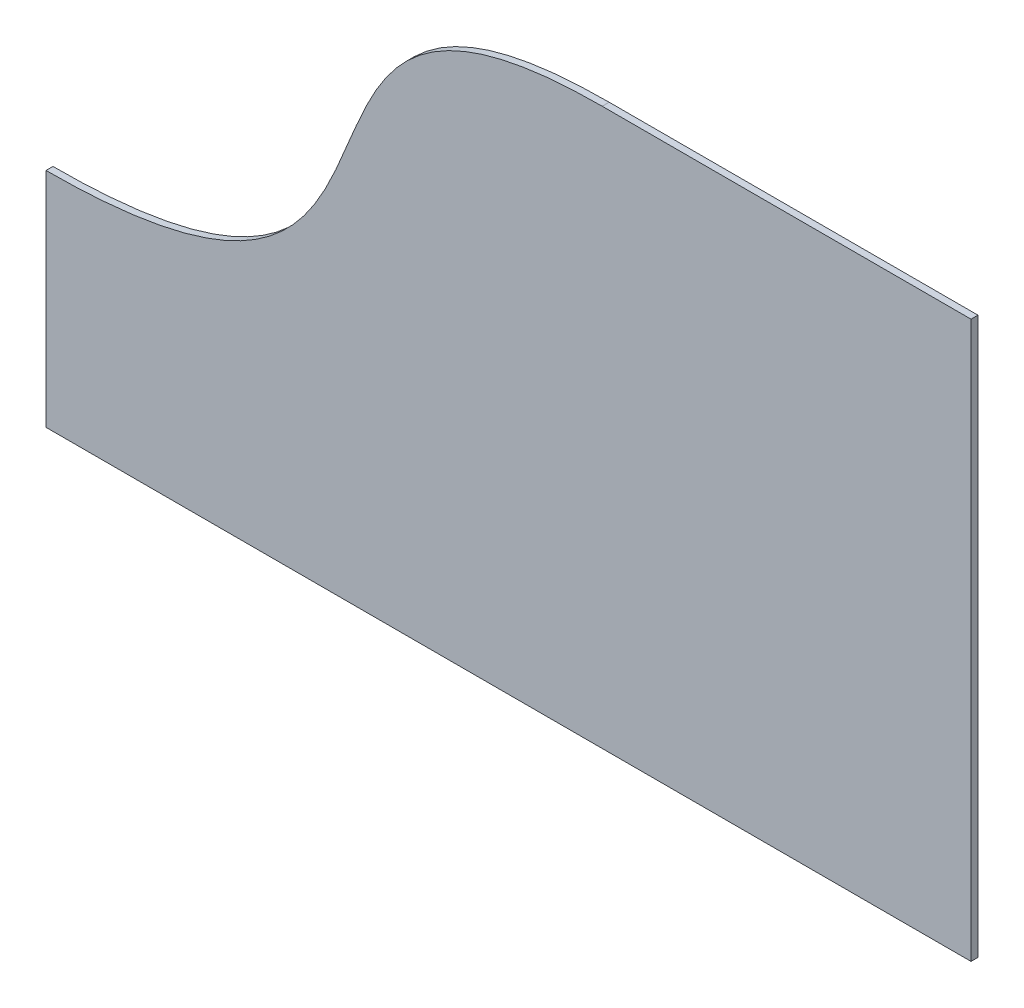
ISO-10303-21;
HEADER;
FILE_DESCRIPTION(('STEP AP214'),'2;1');
FILE_NAME('part.step','',(''),(''),'','','');
FILE_SCHEMA(('AUTOMOTIVE_DESIGN { 1 0 10303 214 1 1 1 1 }'));
ENDSEC;
DATA;
#1=APPLICATION_CONTEXT('core data for automotive mechanical design processes');
#2=APPLICATION_PROTOCOL_DEFINITION('international standard','automotive_design',2000,#1);
#3=PRODUCT_CONTEXT('',#1,'mechanical');
#4=PRODUCT('Part','Part','',(#3));
#5=PRODUCT_RELATED_PRODUCT_CATEGORY('part','',(#4));
#6=PRODUCT_DEFINITION_FORMATION('','',#4);
#7=PRODUCT_DEFINITION_CONTEXT('part definition',#1,'design');
#8=PRODUCT_DEFINITION('design','',#6,#7);
#9=PRODUCT_DEFINITION_SHAPE('','',#8);
#10=(LENGTH_UNIT() NAMED_UNIT(*) SI_UNIT(.MILLI.,.METRE.));
#11=(NAMED_UNIT(*) PLANE_ANGLE_UNIT() SI_UNIT($,.RADIAN.));
#12=(NAMED_UNIT(*) SI_UNIT($,.STERADIAN.) SOLID_ANGLE_UNIT());
#13=UNCERTAINTY_MEASURE_WITH_UNIT(LENGTH_MEASURE(1.E-05),#10,'distance_accuracy_value','');
#14=(GEOMETRIC_REPRESENTATION_CONTEXT(3) GLOBAL_UNCERTAINTY_ASSIGNED_CONTEXT((#13)) GLOBAL_UNIT_ASSIGNED_CONTEXT((#10,
#11,#12)) REPRESENTATION_CONTEXT('',''));
#15=CARTESIAN_POINT('',(0.,0.,0.));
#16=DIRECTION('',(0.,0.,1.));
#17=DIRECTION('',(1.,0.,0.));
#18=AXIS2_PLACEMENT_3D('',#15,#16,#17);
#19=CARTESIAN_POINT('',(-18.7822876391068,213.341972063542,3.175));
#20=CARTESIAN_POINT('',(-196.582287639107,213.341972063542,3.175));
#21=CARTESIAN_POINT('',(-69.5822876391068,60.9419720635418,3.175));
#22=CARTESIAN_POINT('',(-272.782287639107,60.9419720635417,3.175));
#23=B_SPLINE_CURVE_WITH_KNOTS('',3,(#19,#20,#21,#22),.UNSPECIFIED.,.F.,.F.,(4,4),(0.,1.),.UNSPECIFIED.);
#24=DIRECTION('',(0.,0.,-1.));
#25=VECTOR('',#24,1.);
#26=SURFACE_OF_LINEAR_EXTRUSION('',#23,#25);
#27=CARTESIAN_POINT('',(-18.7822876391068,213.341972063542,0.));
#28=CARTESIAN_POINT('',(-196.582287639107,213.341972063542,0.));
#29=CARTESIAN_POINT('',(-69.5822876391068,60.9419720635418,0.));
#30=CARTESIAN_POINT('',(-272.782287639107,60.9419720635417,0.));
#31=B_SPLINE_CURVE_WITH_KNOTS('',3,(#27,#28,#29,#30),.UNSPECIFIED.,.F.,.F.,(4,4),(0.,1.),.UNSPECIFIED.);
#32=CARTESIAN_POINT('',(-18.7822876391068,213.341972063542,0.));
#33=VERTEX_POINT('',#32);
#34=CARTESIAN_POINT('',(-272.782287639107,60.9419720635417,0.));
#35=VERTEX_POINT('',#34);
#36=EDGE_CURVE('E114',#33,#35,#31,.T.);
#37=ORIENTED_EDGE('',*,*,#36,.T.);
#38=DIRECTION('',(0.,0.,-1.));
#39=VECTOR('',#38,1.);
#40=CARTESIAN_POINT('',(-272.782287639107,60.9419720635417,3.175));
#41=LINE('',#40,#39);
#42=CARTESIAN_POINT('',(-272.782287639107,60.9419720635417,3.175));
#43=VERTEX_POINT('',#42);
#44=EDGE_CURVE('E11',#43,#35,#41,.T.);
#45=ORIENTED_EDGE('',*,*,#44,.F.);
#46=CARTESIAN_POINT('',(-18.7822876391068,213.341972063542,3.175));
#47=VERTEX_POINT('',#46);
#48=EDGE_CURVE('E127',#47,#43,#23,.T.);
#49=ORIENTED_EDGE('',*,*,#48,.F.);
#50=DIRECTION('',(0.,0.,-1.));
#51=VECTOR('',#50,1.);
#52=CARTESIAN_POINT('',(-18.7822876391068,213.341972063542,3.175));
#53=LINE('',#52,#51);
#54=EDGE_CURVE('E110',#47,#33,#53,.T.);
#55=ORIENTED_EDGE('',*,*,#54,.T.);
#56=EDGE_LOOP('',(#37,#45,#49,#55));
#57=FACE_BOUND('',#56,.T.);
#58=ADVANCED_FACE('F39',(#57),#26,.F.);
#59=CARTESIAN_POINT('',(-272.782287639107,-40.6580279364584,3.175));
#60=DIRECTION('',(1.,0.,0.));
#61=DIRECTION('',(0.,0.,-1.));
#62=AXIS2_PLACEMENT_3D('',#59,#60,#61);
#63=PLANE('',#62);
#64=DIRECTION('',(0.,-1.,0.));
#65=VECTOR('',#64,1.);
#66=CARTESIAN_POINT('',(-272.782287639107,-40.6580279364584,0.));
#67=LINE('',#66,#65);
#68=CARTESIAN_POINT('',(-272.782287639107,-40.6580279364584,0.));
#69=VERTEX_POINT('',#68);
#70=EDGE_CURVE('E119',#35,#69,#67,.T.);
#71=ORIENTED_EDGE('',*,*,#70,.T.);
#72=DIRECTION('',(0.,0.,-1.));
#73=VECTOR('',#72,1.);
#74=CARTESIAN_POINT('',(-272.782287639107,-40.6580279364584,3.175));
#75=LINE('',#74,#73);
#76=CARTESIAN_POINT('',(-272.782287639107,-40.6580279364584,3.175));
#77=VERTEX_POINT('',#76);
#78=EDGE_CURVE('E48',#77,#69,#75,.T.);
#79=ORIENTED_EDGE('',*,*,#78,.F.);
#80=DIRECTION('',(0.,-1.,0.));
#81=VECTOR('',#80,1.);
#82=CARTESIAN_POINT('',(-272.782287639107,-40.6580279364584,3.175));
#83=LINE('',#82,#81);
#84=EDGE_CURVE('E90',#43,#77,#83,.T.);
#85=ORIENTED_EDGE('',*,*,#84,.F.);
#86=ORIENTED_EDGE('',*,*,#44,.T.);
#87=EDGE_LOOP('',(#71,#79,#85,#86));
#88=FACE_BOUND('',#87,.T.);
#89=ADVANCED_FACE('F146',(#88),#63,.F.);
#90=CARTESIAN_POINT('',(-272.782287639107,-40.6580279364584,3.175));
#91=DIRECTION('',(0.,1.,0.));
#92=DIRECTION('',(0.,0.,1.));
#93=AXIS2_PLACEMENT_3D('',#90,#91,#92);
#94=PLANE('',#93);
#95=DIRECTION('',(1.,0.,0.));
#96=VECTOR('',#95,1.);
#97=CARTESIAN_POINT('',(-272.782287639107,-40.6580279364584,0.));
#98=LINE('',#97,#96);
#99=CARTESIAN_POINT('',(149.647712360893,-40.6580279364584,0.));
#100=VERTEX_POINT('',#99);
#101=EDGE_CURVE('E105',#69,#100,#98,.T.);
#102=ORIENTED_EDGE('',*,*,#101,.T.);
#103=DIRECTION('',(0.,0.,-1.));
#104=VECTOR('',#103,1.);
#105=CARTESIAN_POINT('',(149.647712360893,-40.6580279364584,3.175));
#106=LINE('',#105,#104);
#107=CARTESIAN_POINT('',(149.647712360893,-40.6580279364584,3.175));
#108=VERTEX_POINT('',#107);
#109=EDGE_CURVE('E102',#108,#100,#106,.T.);
#110=ORIENTED_EDGE('',*,*,#109,.F.);
#111=DIRECTION('',(1.,0.,0.));
#112=VECTOR('',#111,1.);
#113=CARTESIAN_POINT('',(-272.782287639107,-40.6580279364584,3.175));
#114=LINE('',#113,#112);
#115=EDGE_CURVE('E94',#77,#108,#114,.T.);
#116=ORIENTED_EDGE('',*,*,#115,.F.);
#117=ORIENTED_EDGE('',*,*,#78,.T.);
#118=EDGE_LOOP('',(#102,#110,#116,#117));
#119=FACE_BOUND('',#118,.T.);
#120=ADVANCED_FACE('F103',(#119),#94,.F.);
#121=CARTESIAN_POINT('',(149.647712360893,213.341972063542,3.175));
#122=DIRECTION('',(-1.,0.,0.));
#123=DIRECTION('',(0.,-1.,0.));
#124=AXIS2_PLACEMENT_3D('',#121,#122,#123);
#125=PLANE('',#124);
#126=DIRECTION('',(0.,1.,0.));
#127=VECTOR('',#126,1.);
#128=CARTESIAN_POINT('',(149.647712360893,213.341972063542,0.));
#129=LINE('',#128,#127);
#130=CARTESIAN_POINT('',(149.647712360893,213.341972063542,0.));
#131=VERTEX_POINT('',#130);
#132=EDGE_CURVE('E76',#100,#131,#129,.T.);
#133=ORIENTED_EDGE('',*,*,#132,.T.);
#134=DIRECTION('',(0.,0.,-1.));
#135=VECTOR('',#134,1.);
#136=CARTESIAN_POINT('',(149.647712360893,213.341972063542,3.175));
#137=LINE('',#136,#135);
#138=CARTESIAN_POINT('',(149.647712360893,213.341972063542,3.175));
#139=VERTEX_POINT('',#138);
#140=EDGE_CURVE('E106',#139,#131,#137,.T.);
#141=ORIENTED_EDGE('',*,*,#140,.F.);
#142=DIRECTION('',(0.,1.,0.));
#143=VECTOR('',#142,1.);
#144=CARTESIAN_POINT('',(149.647712360893,213.341972063542,3.175));
#145=LINE('',#144,#143);
#146=EDGE_CURVE('E98',#108,#139,#145,.T.);
#147=ORIENTED_EDGE('',*,*,#146,.F.);
#148=ORIENTED_EDGE('',*,*,#109,.T.);
#149=EDGE_LOOP('',(#133,#141,#147,#148));
#150=FACE_BOUND('',#149,.T.);
#151=ADVANCED_FACE('F108',(#150),#125,.F.);
#152=CARTESIAN_POINT('',(149.647712360893,213.341972063542,3.175));
#153=DIRECTION('',(0.,-1.,0.));
#154=DIRECTION('',(1.,0.,0.));
#155=AXIS2_PLACEMENT_3D('',#152,#153,#154);
#156=PLANE('',#155);
#157=DIRECTION('',(-1.,0.,0.));
#158=VECTOR('',#157,1.);
#159=CARTESIAN_POINT('',(149.647712360893,213.341972063542,0.));
#160=LINE('',#159,#158);
#161=EDGE_CURVE('E82',#131,#33,#160,.T.);
#162=ORIENTED_EDGE('',*,*,#161,.T.);
#163=ORIENTED_EDGE('',*,*,#54,.F.);
#164=DIRECTION('',(-1.,0.,0.));
#165=VECTOR('',#164,1.);
#166=CARTESIAN_POINT('',(149.647712360893,213.341972063542,3.175));
#167=LINE('',#166,#165);
#168=EDGE_CURVE('E56',#139,#47,#167,.T.);
#169=ORIENTED_EDGE('',*,*,#168,.F.);
#170=ORIENTED_EDGE('',*,*,#140,.T.);
#171=EDGE_LOOP('',(#162,#163,#169,#170));
#172=FACE_BOUND('',#171,.T.);
#173=ADVANCED_FACE('F135',(#172),#156,.F.);
#174=CARTESIAN_POINT('',(-136.257287639107,137.141972063542,3.175));
#175=DIRECTION('',(0.,0.,-1.));
#176=DIRECTION('',(-1.,0.,0.));
#177=AXIS2_PLACEMENT_3D('',#174,#175,#176);
#178=PLANE('',#177);
#179=ORIENTED_EDGE('',*,*,#48,.T.);
#180=ORIENTED_EDGE('',*,*,#84,.T.);
#181=ORIENTED_EDGE('',*,*,#115,.T.);
#182=ORIENTED_EDGE('',*,*,#146,.T.);
#183=ORIENTED_EDGE('',*,*,#168,.T.);
#184=EDGE_LOOP('',(#179,#180,#181,#182,#183));
#185=FACE_BOUND('',#184,.T.);
#186=ADVANCED_FACE('F96',(#185),#178,.F.);
#187=CARTESIAN_POINT('',(-136.257287639107,137.141972063542,0.));
#188=DIRECTION('',(0.,0.,-1.));
#189=DIRECTION('',(-1.,0.,0.));
#190=AXIS2_PLACEMENT_3D('',#187,#188,#189);
#191=PLANE('',#190);
#192=ORIENTED_EDGE('',*,*,#36,.F.);
#193=ORIENTED_EDGE('',*,*,#161,.F.);
#194=ORIENTED_EDGE('',*,*,#132,.F.);
#195=ORIENTED_EDGE('',*,*,#101,.F.);
#196=ORIENTED_EDGE('',*,*,#70,.F.);
#197=EDGE_LOOP('',(#192,#193,#194,#195,#196));
#198=FACE_BOUND('',#197,.T.);
#199=ADVANCED_FACE('F131',(#198),#191,.T.);
#200=CLOSED_SHELL('',(#58,#89,#120,#151,#173,#186,#199));
#201=MANIFOLD_SOLID_BREP('B2',#200);
#202=ADVANCED_BREP_SHAPE_REPRESENTATION('',(#18,#201),#14);
#203=SHAPE_DEFINITION_REPRESENTATION(#9,#202);
ENDSEC;
END-ISO-10303-21;
